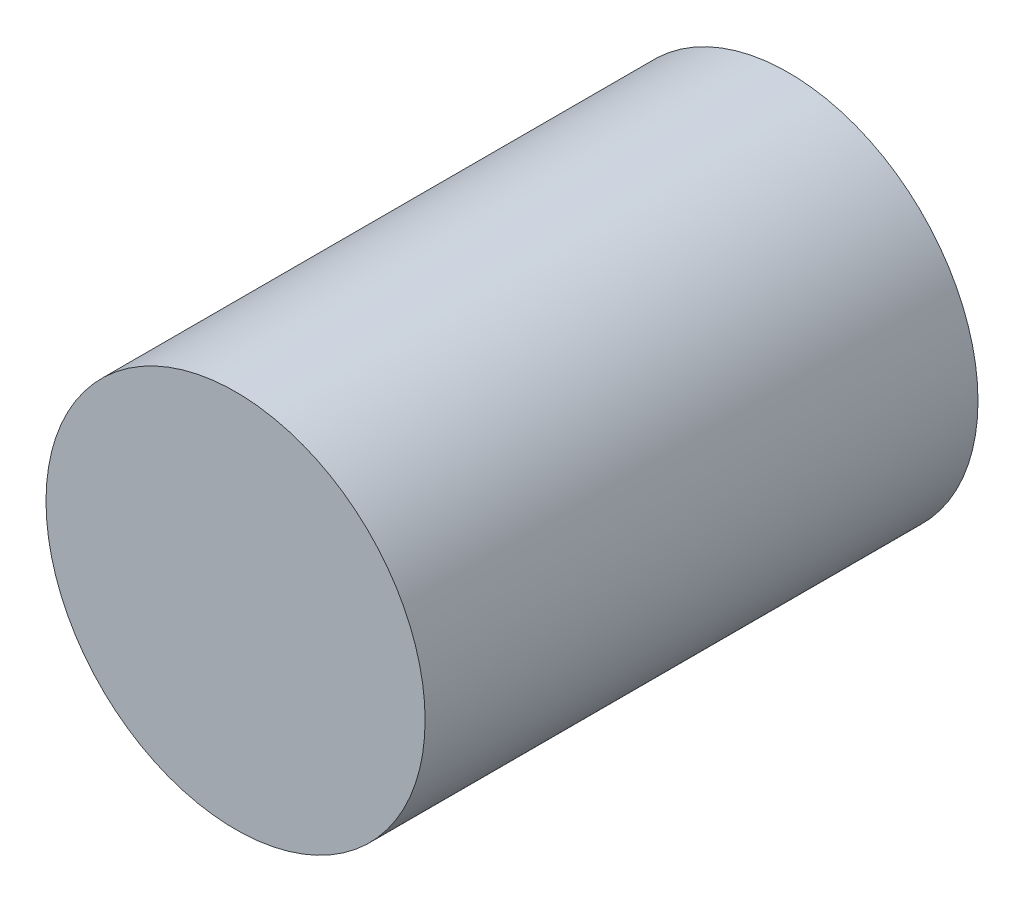
ISO-10303-21;
HEADER;
FILE_DESCRIPTION(('STEP AP214'),'2;1');
FILE_NAME('part.step','',(''),(''),'','','');
FILE_SCHEMA(('AUTOMOTIVE_DESIGN { 1 0 10303 214 1 1 1 1 }'));
ENDSEC;
DATA;
#1=APPLICATION_CONTEXT('core data for automotive mechanical design processes');
#2=APPLICATION_PROTOCOL_DEFINITION('international standard','automotive_design',2000,#1);
#3=PRODUCT_CONTEXT('',#1,'mechanical');
#4=PRODUCT('Part','Part','',(#3));
#5=PRODUCT_RELATED_PRODUCT_CATEGORY('part','',(#4));
#6=PRODUCT_DEFINITION_FORMATION('','',#4);
#7=PRODUCT_DEFINITION_CONTEXT('part definition',#1,'design');
#8=PRODUCT_DEFINITION('design','',#6,#7);
#9=PRODUCT_DEFINITION_SHAPE('','',#8);
#10=(LENGTH_UNIT() NAMED_UNIT(*) SI_UNIT(.MILLI.,.METRE.));
#11=(NAMED_UNIT(*) PLANE_ANGLE_UNIT() SI_UNIT($,.RADIAN.));
#12=(NAMED_UNIT(*) SI_UNIT($,.STERADIAN.) SOLID_ANGLE_UNIT());
#13=UNCERTAINTY_MEASURE_WITH_UNIT(LENGTH_MEASURE(1.E-05),#10,'distance_accuracy_value','');
#14=(GEOMETRIC_REPRESENTATION_CONTEXT(3) GLOBAL_UNCERTAINTY_ASSIGNED_CONTEXT((#13)) GLOBAL_UNIT_ASSIGNED_CONTEXT((#10,
#11,#12)) REPRESENTATION_CONTEXT('',''));
#15=CARTESIAN_POINT('',(0.,0.,0.));
#16=DIRECTION('',(0.,0.,1.));
#17=DIRECTION('',(1.,0.,0.));
#18=AXIS2_PLACEMENT_3D('',#15,#16,#17);
#19=CARTESIAN_POINT('',(0.,0.,50.7492));
#20=DIRECTION('',(0.,0.,-1.));
#21=DIRECTION('',(-1.,0.,0.));
#22=AXIS2_PLACEMENT_3D('',#19,#20,#21);
#23=CYLINDRICAL_SURFACE('',#22,17.399);
#24=CARTESIAN_POINT('',(0.,0.,50.7492));
#25=DIRECTION('',(0.,0.,1.));
#26=DIRECTION('',(1.,0.,0.));
#27=AXIS2_PLACEMENT_3D('',#24,#25,#26);
#28=CIRCLE('',#27,17.399);
#29=CARTESIAN_POINT('',(17.399,0.,50.7492));
#30=VERTEX_POINT('',#29);
#31=EDGE_CURVE('E10',#30,#30,#28,.T.);
#32=ORIENTED_EDGE('',*,*,#31,.F.);
#33=EDGE_LOOP('',(#32));
#34=FACE_BOUND('',#33,.T.);
#35=CARTESIAN_POINT('',(0.,0.,0.));
#36=DIRECTION('',(0.,0.,1.));
#37=DIRECTION('',(1.,0.,0.));
#38=AXIS2_PLACEMENT_3D('',#35,#36,#37);
#39=CIRCLE('',#38,17.399);
#40=CARTESIAN_POINT('',(17.399,0.,0.));
#41=VERTEX_POINT('',#40);
#42=EDGE_CURVE('E35',#41,#41,#39,.T.);
#43=ORIENTED_EDGE('',*,*,#42,.T.);
#44=EDGE_LOOP('',(#43));
#45=FACE_BOUND('',#44,.T.);
#46=ADVANCED_FACE('F32',(#34,#45),#23,.T.);
#47=CARTESIAN_POINT('',(0.,0.,50.7492));
#48=DIRECTION('',(0.,0.,1.));
#49=DIRECTION('',(1.,0.,0.));
#50=AXIS2_PLACEMENT_3D('',#47,#48,#49);
#51=PLANE('',#50);
#52=ORIENTED_EDGE('',*,*,#31,.T.);
#53=EDGE_LOOP('',(#52));
#54=FACE_BOUND('',#53,.T.);
#55=ADVANCED_FACE('F47',(#54),#51,.T.);
#56=CARTESIAN_POINT('',(0.,0.,0.));
#57=DIRECTION('',(0.,0.,1.));
#58=DIRECTION('',(1.,0.,0.));
#59=AXIS2_PLACEMENT_3D('',#56,#57,#58);
#60=PLANE('',#59);
#61=ORIENTED_EDGE('',*,*,#42,.F.);
#62=EDGE_LOOP('',(#61));
#63=FACE_BOUND('',#62,.T.);
#64=ADVANCED_FACE('F45',(#63),#60,.F.);
#65=CLOSED_SHELL('',(#46,#55,#64));
#66=MANIFOLD_SOLID_BREP('B2',#65);
#67=ADVANCED_BREP_SHAPE_REPRESENTATION('',(#18,#66),#14);
#68=SHAPE_DEFINITION_REPRESENTATION(#9,#67);
ENDSEC;
END-ISO-10303-21;
